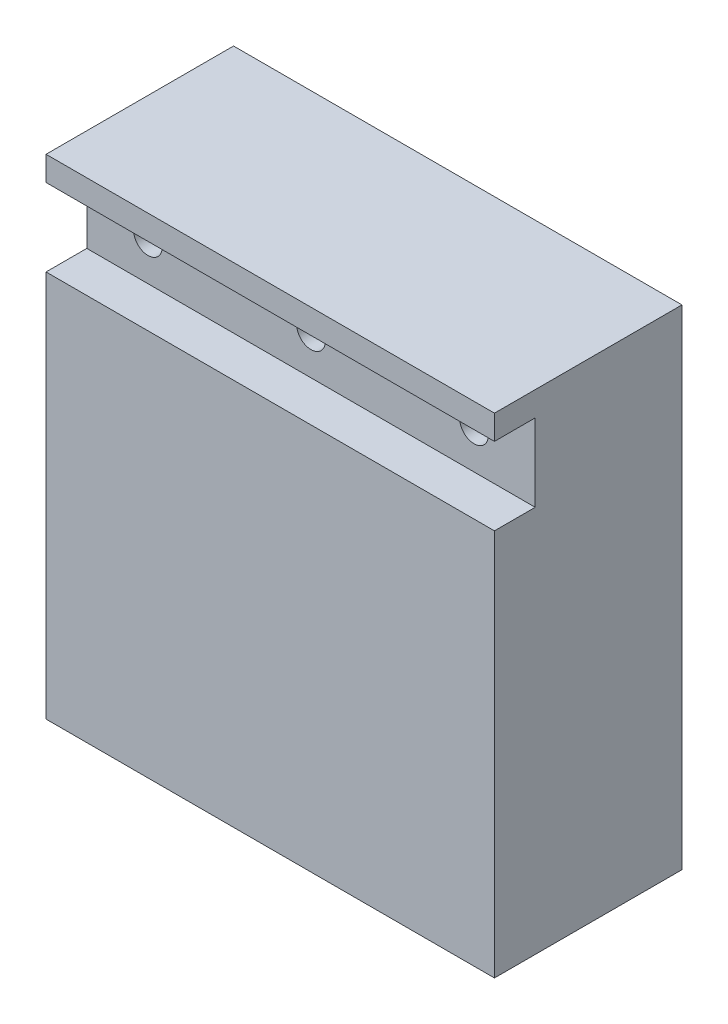
ISO-10303-21;
HEADER;
FILE_DESCRIPTION(('STEP AP214'),'2;1');
FILE_NAME('part.step','',(''),(''),'','','');
FILE_SCHEMA(('AUTOMOTIVE_DESIGN { 1 0 10303 214 1 1 1 1 }'));
ENDSEC;
DATA;
#1=APPLICATION_CONTEXT('core data for automotive mechanical design processes');
#2=APPLICATION_PROTOCOL_DEFINITION('international standard','automotive_design',2000,#1);
#3=PRODUCT_CONTEXT('',#1,'mechanical');
#4=PRODUCT('Part','Part','',(#3));
#5=PRODUCT_RELATED_PRODUCT_CATEGORY('part','',(#4));
#6=PRODUCT_DEFINITION_FORMATION('','',#4);
#7=PRODUCT_DEFINITION_CONTEXT('part definition',#1,'design');
#8=PRODUCT_DEFINITION('design','',#6,#7);
#9=PRODUCT_DEFINITION_SHAPE('','',#8);
#10=(LENGTH_UNIT() NAMED_UNIT(*) SI_UNIT(.MILLI.,.METRE.));
#11=(NAMED_UNIT(*) PLANE_ANGLE_UNIT() SI_UNIT($,.RADIAN.));
#12=(NAMED_UNIT(*) SI_UNIT($,.STERADIAN.) SOLID_ANGLE_UNIT());
#13=UNCERTAINTY_MEASURE_WITH_UNIT(LENGTH_MEASURE(1.E-05),#10,'distance_accuracy_value','');
#14=(GEOMETRIC_REPRESENTATION_CONTEXT(3) GLOBAL_UNCERTAINTY_ASSIGNED_CONTEXT((#13)) GLOBAL_UNIT_ASSIGNED_CONTEXT((#10,
#11,#12)) REPRESENTATION_CONTEXT('',''));
#15=CARTESIAN_POINT('',(0.,0.,0.));
#16=DIRECTION('',(0.,0.,1.));
#17=DIRECTION('',(1.,0.,0.));
#18=AXIS2_PLACEMENT_3D('',#15,#16,#17);
#19=CARTESIAN_POINT('',(55.,0.,0.));
#20=DIRECTION('',(0.,0.,-1.));
#21=DIRECTION('',(-1.,0.,0.));
#22=AXIS2_PLACEMENT_3D('',#19,#20,#21);
#23=PLANE('',#22);
#24=DIRECTION('',(0.,-1.,0.));
#25=VECTOR('',#24,1.);
#26=CARTESIAN_POINT('',(0.,0.,0.));
#27=LINE('',#26,#25);
#28=CARTESIAN_POINT('',(0.,60.,0.));
#29=VERTEX_POINT('',#28);
#30=CARTESIAN_POINT('',(0.,57.,0.));
#31=VERTEX_POINT('',#30);
#32=EDGE_CURVE('E162',#29,#31,#27,.T.);
#33=ORIENTED_EDGE('',*,*,#32,.T.);
#34=DIRECTION('',(-1.,0.,0.));
#35=VECTOR('',#34,1.);
#36=CARTESIAN_POINT('',(0.,57.,0.));
#37=LINE('',#36,#35);
#38=CARTESIAN_POINT('',(55.,57.,0.));
#39=VERTEX_POINT('',#38);
#40=EDGE_CURVE('E135',#39,#31,#37,.T.);
#41=ORIENTED_EDGE('',*,*,#40,.F.);
#42=DIRECTION('',(0.,-1.,0.));
#43=VECTOR('',#42,1.);
#44=CARTESIAN_POINT('',(55.,0.,0.));
#45=LINE('',#44,#43);
#46=CARTESIAN_POINT('',(55.,60.,0.));
#47=VERTEX_POINT('',#46);
#48=EDGE_CURVE('E150',#47,#39,#45,.T.);
#49=ORIENTED_EDGE('',*,*,#48,.F.);
#50=DIRECTION('',(-1.,0.,0.));
#51=VECTOR('',#50,1.);
#52=CARTESIAN_POINT('',(55.,60.,0.));
#53=LINE('',#52,#51);
#54=EDGE_CURVE('E161',#47,#29,#53,.T.);
#55=ORIENTED_EDGE('',*,*,#54,.T.);
#56=EDGE_LOOP('',(#33,#41,#49,#55));
#57=FACE_BOUND('',#56,.T.);
#58=ADVANCED_FACE('F43',(#57),#23,.F.);
#59=CARTESIAN_POINT('',(55.,47.5,0.));
#60=VERTEX_POINT('',#59);
#61=CARTESIAN_POINT('',(55.,0.,0.));
#62=VERTEX_POINT('',#61);
#63=EDGE_CURVE('E96',#60,#62,#45,.T.);
#64=ORIENTED_EDGE('',*,*,#63,.F.);
#65=DIRECTION('',(1.,0.,0.));
#66=VECTOR('',#65,1.);
#67=CARTESIAN_POINT('',(0.,47.5,0.));
#68=LINE('',#67,#66);
#69=CARTESIAN_POINT('',(0.,47.5,0.));
#70=VERTEX_POINT('',#69);
#71=EDGE_CURVE('E213',#70,#60,#68,.T.);
#72=ORIENTED_EDGE('',*,*,#71,.F.);
#73=CARTESIAN_POINT('',(0.,0.,0.));
#74=VERTEX_POINT('',#73);
#75=EDGE_CURVE('E140',#70,#74,#27,.T.);
#76=ORIENTED_EDGE('',*,*,#75,.T.);
#77=DIRECTION('',(-1.,0.,0.));
#78=VECTOR('',#77,1.);
#79=CARTESIAN_POINT('',(55.,0.,0.));
#80=LINE('',#79,#78);
#81=EDGE_CURVE('E11',#62,#74,#80,.T.);
#82=ORIENTED_EDGE('',*,*,#81,.F.);
#83=EDGE_LOOP('',(#64,#72,#76,#82));
#84=FACE_BOUND('',#83,.T.);
#85=ADVANCED_FACE('F45',(#84),#23,.F.);
#86=CARTESIAN_POINT('',(55.,0.,0.));
#87=DIRECTION('',(0.,1.,0.));
#88=DIRECTION('',(0.,0.,1.));
#89=AXIS2_PLACEMENT_3D('',#86,#87,#88);
#90=PLANE('',#89);
#91=DIRECTION('',(0.,0.,-1.));
#92=VECTOR('',#91,1.);
#93=CARTESIAN_POINT('',(0.,0.,0.));
#94=LINE('',#93,#92);
#95=CARTESIAN_POINT('',(0.,0.,-23.));
#96=VERTEX_POINT('',#95);
#97=EDGE_CURVE('E166',#74,#96,#94,.T.);
#98=ORIENTED_EDGE('',*,*,#97,.T.);
#99=DIRECTION('',(-1.,0.,0.));
#100=VECTOR('',#99,1.);
#101=CARTESIAN_POINT('',(55.,0.,-23.));
#102=LINE('',#101,#100);
#103=CARTESIAN_POINT('',(55.,0.,-23.));
#104=VERTEX_POINT('',#103);
#105=EDGE_CURVE('E52',#104,#96,#102,.T.);
#106=ORIENTED_EDGE('',*,*,#105,.F.);
#107=DIRECTION('',(0.,0.,-1.));
#108=VECTOR('',#107,1.);
#109=CARTESIAN_POINT('',(55.,0.,0.));
#110=LINE('',#109,#108);
#111=EDGE_CURVE('E153',#62,#104,#110,.T.);
#112=ORIENTED_EDGE('',*,*,#111,.F.);
#113=ORIENTED_EDGE('',*,*,#81,.T.);
#114=EDGE_LOOP('',(#98,#106,#112,#113));
#115=FACE_BOUND('',#114,.T.);
#116=ADVANCED_FACE('F201',(#115),#90,.F.);
#117=CARTESIAN_POINT('',(55.,0.,-23.));
#118=DIRECTION('',(0.,0.,1.));
#119=DIRECTION('',(1.,0.,0.));
#120=AXIS2_PLACEMENT_3D('',#117,#118,#119);
#121=PLANE('',#120);
#122=DIRECTION('',(0.,1.,0.));
#123=VECTOR('',#122,1.);
#124=CARTESIAN_POINT('',(0.,0.,-23.));
#125=LINE('',#124,#123);
#126=CARTESIAN_POINT('',(0.,60.,-23.));
#127=VERTEX_POINT('',#126);
#128=EDGE_CURVE('E169',#96,#127,#125,.T.);
#129=ORIENTED_EDGE('',*,*,#128,.T.);
#130=DIRECTION('',(-1.,0.,0.));
#131=VECTOR('',#130,1.);
#132=CARTESIAN_POINT('',(55.,60.,-23.));
#133=LINE('',#132,#131);
#134=CARTESIAN_POINT('',(55.,60.,-23.));
#135=VERTEX_POINT('',#134);
#136=EDGE_CURVE('E176',#135,#127,#133,.T.);
#137=ORIENTED_EDGE('',*,*,#136,.F.);
#138=DIRECTION('',(0.,1.,0.));
#139=VECTOR('',#138,1.);
#140=CARTESIAN_POINT('',(55.,0.,-23.));
#141=LINE('',#140,#139);
#142=EDGE_CURVE('E156',#104,#135,#141,.T.);
#143=ORIENTED_EDGE('',*,*,#142,.F.);
#144=ORIENTED_EDGE('',*,*,#105,.T.);
#145=EDGE_LOOP('',(#129,#137,#143,#144));
#146=FACE_BOUND('',#145,.T.);
#147=ADVANCED_FACE('F184',(#146),#121,.F.);
#148=CARTESIAN_POINT('',(55.,60.,0.));
#149=DIRECTION('',(0.,-1.,0.));
#150=DIRECTION('',(0.,0.,-1.));
#151=AXIS2_PLACEMENT_3D('',#148,#149,#150);
#152=PLANE('',#151);
#153=DIRECTION('',(0.,0.,1.));
#154=VECTOR('',#153,1.);
#155=CARTESIAN_POINT('',(0.,60.,0.));
#156=LINE('',#155,#154);
#157=EDGE_CURVE('E89',#127,#29,#156,.T.);
#158=ORIENTED_EDGE('',*,*,#157,.T.);
#159=ORIENTED_EDGE('',*,*,#54,.F.);
#160=DIRECTION('',(0.,0.,1.));
#161=VECTOR('',#160,1.);
#162=CARTESIAN_POINT('',(55.,60.,0.));
#163=LINE('',#162,#161);
#164=EDGE_CURVE('E68',#135,#47,#163,.T.);
#165=ORIENTED_EDGE('',*,*,#164,.F.);
#166=ORIENTED_EDGE('',*,*,#136,.T.);
#167=EDGE_LOOP('',(#158,#159,#165,#166));
#168=FACE_BOUND('',#167,.T.);
#169=ADVANCED_FACE('F192',(#168),#152,.F.);
#170=CARTESIAN_POINT('',(55.,0.,0.));
#171=DIRECTION('',(-1.,0.,0.));
#172=DIRECTION('',(0.,0.,1.));
#173=AXIS2_PLACEMENT_3D('',#170,#171,#172);
#174=PLANE('',#173);
#175=ORIENTED_EDGE('',*,*,#48,.T.);
#176=DIRECTION('',(0.,0.,1.));
#177=VECTOR('',#176,1.);
#178=CARTESIAN_POINT('',(55.,57.,-5.));
#179=LINE('',#178,#177);
#180=CARTESIAN_POINT('',(55.,57.,-5.));
#181=VERTEX_POINT('',#180);
#182=EDGE_CURVE('E145',#181,#39,#179,.T.);
#183=ORIENTED_EDGE('',*,*,#182,.F.);
#184=DIRECTION('',(0.,1.,0.));
#185=VECTOR('',#184,1.);
#186=CARTESIAN_POINT('',(55.,57.,-5.));
#187=LINE('',#186,#185);
#188=CARTESIAN_POINT('',(55.,47.5,-5.));
#189=VERTEX_POINT('',#188);
#190=EDGE_CURVE('E127',#189,#181,#187,.T.);
#191=ORIENTED_EDGE('',*,*,#190,.F.);
#192=DIRECTION('',(0.,0.,1.));
#193=VECTOR('',#192,1.);
#194=CARTESIAN_POINT('',(55.,47.5,-5.));
#195=LINE('',#194,#193);
#196=EDGE_CURVE('E124',#189,#60,#195,.T.);
#197=ORIENTED_EDGE('',*,*,#196,.T.);
#198=ORIENTED_EDGE('',*,*,#63,.T.);
#199=ORIENTED_EDGE('',*,*,#111,.T.);
#200=ORIENTED_EDGE('',*,*,#142,.T.);
#201=ORIENTED_EDGE('',*,*,#164,.T.);
#202=EDGE_LOOP('',(#175,#183,#191,#197,#198,#199,#200,#201));
#203=FACE_BOUND('',#202,.T.);
#204=ADVANCED_FACE('F194',(#203),#174,.F.);
#205=CARTESIAN_POINT('',(0.,0.,0.));
#206=DIRECTION('',(-1.,0.,0.));
#207=DIRECTION('',(0.,0.,1.));
#208=AXIS2_PLACEMENT_3D('',#205,#206,#207);
#209=PLANE('',#208);
#210=DIRECTION('',(0.,0.,1.));
#211=VECTOR('',#210,1.);
#212=CARTESIAN_POINT('',(0.,57.,-5.));
#213=LINE('',#212,#211);
#214=CARTESIAN_POINT('',(0.,57.,-5.));
#215=VERTEX_POINT('',#214);
#216=EDGE_CURVE('E188',#215,#31,#213,.T.);
#217=ORIENTED_EDGE('',*,*,#216,.T.);
#218=ORIENTED_EDGE('',*,*,#32,.F.);
#219=ORIENTED_EDGE('',*,*,#157,.F.);
#220=ORIENTED_EDGE('',*,*,#128,.F.);
#221=ORIENTED_EDGE('',*,*,#97,.F.);
#222=ORIENTED_EDGE('',*,*,#75,.F.);
#223=DIRECTION('',(0.,0.,1.));
#224=VECTOR('',#223,1.);
#225=CARTESIAN_POINT('',(0.,47.5,-5.));
#226=LINE('',#225,#224);
#227=CARTESIAN_POINT('',(0.,47.5,-5.));
#228=VERTEX_POINT('',#227);
#229=EDGE_CURVE('E122',#228,#70,#226,.T.);
#230=ORIENTED_EDGE('',*,*,#229,.F.);
#231=DIRECTION('',(0.,-1.,0.));
#232=VECTOR('',#231,1.);
#233=CARTESIAN_POINT('',(0.,57.,-5.));
#234=LINE('',#233,#232);
#235=EDGE_CURVE('E128',#215,#228,#234,.T.);
#236=ORIENTED_EDGE('',*,*,#235,.F.);
#237=EDGE_LOOP('',(#217,#218,#219,#220,#221,#222,#230,#236));
#238=FACE_BOUND('',#237,.T.);
#239=ADVANCED_FACE('F138',(#238),#209,.T.);
#240=CARTESIAN_POINT('',(0.,57.,-5.));
#241=DIRECTION('',(0.,1.,0.));
#242=DIRECTION('',(0.,0.,1.));
#243=AXIS2_PLACEMENT_3D('',#240,#241,#242);
#244=PLANE('',#243);
#245=ORIENTED_EDGE('',*,*,#40,.T.);
#246=ORIENTED_EDGE('',*,*,#216,.F.);
#247=DIRECTION('',(-1.,0.,0.));
#248=VECTOR('',#247,1.);
#249=CARTESIAN_POINT('',(0.,57.,-5.));
#250=LINE('',#249,#248);
#251=EDGE_CURVE('E59',#181,#215,#250,.T.);
#252=ORIENTED_EDGE('',*,*,#251,.F.);
#253=ORIENTED_EDGE('',*,*,#182,.T.);
#254=EDGE_LOOP('',(#245,#246,#252,#253));
#255=FACE_BOUND('',#254,.T.);
#256=ADVANCED_FACE('F284',(#255),#244,.F.);
#257=CARTESIAN_POINT('',(0.,47.5,-5.));
#258=DIRECTION('',(0.,-1.,0.));
#259=DIRECTION('',(0.,0.,-1.));
#260=AXIS2_PLACEMENT_3D('',#257,#258,#259);
#261=PLANE('',#260);
#262=ORIENTED_EDGE('',*,*,#71,.T.);
#263=ORIENTED_EDGE('',*,*,#196,.F.);
#264=DIRECTION('',(1.,0.,0.));
#265=VECTOR('',#264,1.);
#266=CARTESIAN_POINT('',(0.,47.5,-5.));
#267=LINE('',#266,#265);
#268=EDGE_CURVE('E119',#228,#189,#267,.T.);
#269=ORIENTED_EDGE('',*,*,#268,.F.);
#270=ORIENTED_EDGE('',*,*,#229,.T.);
#271=EDGE_LOOP('',(#262,#263,#269,#270));
#272=FACE_BOUND('',#271,.T.);
#273=ADVANCED_FACE('F120',(#272),#261,.F.);
#274=CARTESIAN_POINT('',(0.,0.,-5.));
#275=DIRECTION('',(0.,0.,1.));
#276=DIRECTION('',(1.,0.,0.));
#277=AXIS2_PLACEMENT_3D('',#274,#275,#276);
#278=PLANE('',#277);
#279=CARTESIAN_POINT('',(7.5,52.25,-5.));
#280=DIRECTION('',(0.,0.,1.));
#281=DIRECTION('',(1.,0.,0.));
#282=AXIS2_PLACEMENT_3D('',#279,#280,#281);
#283=CIRCLE('',#282,1.75);
#284=CARTESIAN_POINT('',(9.25,52.25,-5.));
#285=VERTEX_POINT('',#284);
#286=EDGE_CURVE('E245',#285,#285,#283,.T.);
#287=ORIENTED_EDGE('',*,*,#286,.F.);
#288=EDGE_LOOP('',(#287));
#289=FACE_BOUND('',#288,.T.);
#290=CARTESIAN_POINT('',(27.5,52.25,-5.));
#291=DIRECTION('',(0.,0.,1.));
#292=DIRECTION('',(1.,0.,0.));
#293=AXIS2_PLACEMENT_3D('',#290,#291,#292);
#294=CIRCLE('',#293,1.75);
#295=CARTESIAN_POINT('',(29.25,52.25,-5.));
#296=VERTEX_POINT('',#295);
#297=EDGE_CURVE('E241',#296,#296,#294,.T.);
#298=ORIENTED_EDGE('',*,*,#297,.F.);
#299=EDGE_LOOP('',(#298));
#300=FACE_BOUND('',#299,.T.);
#301=CARTESIAN_POINT('',(47.5,52.25,-5.));
#302=DIRECTION('',(0.,0.,1.));
#303=DIRECTION('',(1.,0.,0.));
#304=AXIS2_PLACEMENT_3D('',#301,#302,#303);
#305=CIRCLE('',#304,1.75);
#306=CARTESIAN_POINT('',(49.25,52.25,-5.));
#307=VERTEX_POINT('',#306);
#308=EDGE_CURVE('E233',#307,#307,#305,.T.);
#309=ORIENTED_EDGE('',*,*,#308,.F.);
#310=EDGE_LOOP('',(#309));
#311=FACE_BOUND('',#310,.T.);
#312=ORIENTED_EDGE('',*,*,#235,.T.);
#313=ORIENTED_EDGE('',*,*,#268,.T.);
#314=ORIENTED_EDGE('',*,*,#190,.T.);
#315=ORIENTED_EDGE('',*,*,#251,.T.);
#316=EDGE_LOOP('',(#312,#313,#314,#315));
#317=FACE_BOUND('',#316,.T.);
#318=ADVANCED_FACE('F131',(#289,#300,#311,#317),#278,.T.);
#319=CARTESIAN_POINT('',(47.5,52.25,-8.));
#320=DIRECTION('',(0.,0.,1.));
#321=DIRECTION('',(1.,0.,0.));
#322=AXIS2_PLACEMENT_3D('',#319,#320,#321);
#323=CYLINDRICAL_SURFACE('',#322,1.75);
#324=CARTESIAN_POINT('',(47.5,52.25,-8.));
#325=DIRECTION('',(0.,0.,1.));
#326=DIRECTION('',(1.,0.,0.));
#327=AXIS2_PLACEMENT_3D('',#324,#325,#326);
#328=CIRCLE('',#327,1.75);
#329=CARTESIAN_POINT('',(49.25,52.25,-8.));
#330=VERTEX_POINT('',#329);
#331=EDGE_CURVE('E229',#330,#330,#328,.T.);
#332=ORIENTED_EDGE('',*,*,#331,.F.);
#333=EDGE_LOOP('',(#332));
#334=FACE_BOUND('',#333,.T.);
#335=ORIENTED_EDGE('',*,*,#308,.T.);
#336=EDGE_LOOP('',(#335));
#337=FACE_BOUND('',#336,.T.);
#338=ADVANCED_FACE('F264',(#334,#337),#323,.F.);
#339=CARTESIAN_POINT('',(47.5,52.25,-8.));
#340=DIRECTION('',(0.,0.,1.));
#341=DIRECTION('',(1.,0.,0.));
#342=AXIS2_PLACEMENT_3D('',#339,#340,#341);
#343=PLANE('',#342);
#344=ORIENTED_EDGE('',*,*,#331,.T.);
#345=EDGE_LOOP('',(#344));
#346=FACE_BOUND('',#345,.T.);
#347=ADVANCED_FACE('F271',(#346),#343,.T.);
#348=CARTESIAN_POINT('',(27.5,52.25,-8.));
#349=DIRECTION('',(0.,0.,1.));
#350=DIRECTION('',(1.,0.,0.));
#351=AXIS2_PLACEMENT_3D('',#348,#349,#350);
#352=CYLINDRICAL_SURFACE('',#351,1.75);
#353=CARTESIAN_POINT('',(27.5,52.25,-8.));
#354=DIRECTION('',(0.,0.,1.));
#355=DIRECTION('',(1.,0.,0.));
#356=AXIS2_PLACEMENT_3D('',#353,#354,#355);
#357=CIRCLE('',#356,1.75);
#358=CARTESIAN_POINT('',(29.25,52.25,-8.));
#359=VERTEX_POINT('',#358);
#360=EDGE_CURVE('E237',#359,#359,#357,.T.);
#361=ORIENTED_EDGE('',*,*,#360,.F.);
#362=EDGE_LOOP('',(#361));
#363=FACE_BOUND('',#362,.T.);
#364=ORIENTED_EDGE('',*,*,#297,.T.);
#365=EDGE_LOOP('',(#364));
#366=FACE_BOUND('',#365,.T.);
#367=ADVANCED_FACE('F277',(#363,#366),#352,.F.);
#368=CARTESIAN_POINT('',(27.5,52.25,-8.));
#369=DIRECTION('',(0.,0.,1.));
#370=DIRECTION('',(1.,0.,0.));
#371=AXIS2_PLACEMENT_3D('',#368,#369,#370);
#372=PLANE('',#371);
#373=ORIENTED_EDGE('',*,*,#360,.T.);
#374=EDGE_LOOP('',(#373));
#375=FACE_BOUND('',#374,.T.);
#376=ADVANCED_FACE('F258',(#375),#372,.T.);
#377=CARTESIAN_POINT('',(7.5,52.25,-8.));
#378=DIRECTION('',(0.,0.,1.));
#379=DIRECTION('',(1.,0.,0.));
#380=AXIS2_PLACEMENT_3D('',#377,#378,#379);
#381=CYLINDRICAL_SURFACE('',#380,1.75);
#382=CARTESIAN_POINT('',(7.5,52.25,-8.));
#383=DIRECTION('',(0.,0.,1.));
#384=DIRECTION('',(1.,0.,0.));
#385=AXIS2_PLACEMENT_3D('',#382,#383,#384);
#386=CIRCLE('',#385,1.75);
#387=CARTESIAN_POINT('',(9.25,52.25,-8.));
#388=VERTEX_POINT('',#387);
#389=EDGE_CURVE('E225',#388,#388,#386,.T.);
#390=ORIENTED_EDGE('',*,*,#389,.F.);
#391=EDGE_LOOP('',(#390));
#392=FACE_BOUND('',#391,.T.);
#393=ORIENTED_EDGE('',*,*,#286,.T.);
#394=EDGE_LOOP('',(#393));
#395=FACE_BOUND('',#394,.T.);
#396=ADVANCED_FACE('F255',(#392,#395),#381,.F.);
#397=CARTESIAN_POINT('',(7.5,52.25,-8.));
#398=DIRECTION('',(0.,0.,1.));
#399=DIRECTION('',(1.,0.,0.));
#400=AXIS2_PLACEMENT_3D('',#397,#398,#399);
#401=PLANE('',#400);
#402=ORIENTED_EDGE('',*,*,#389,.T.);
#403=EDGE_LOOP('',(#402));
#404=FACE_BOUND('',#403,.T.);
#405=ADVANCED_FACE('F253',(#404),#401,.T.);
#406=CLOSED_SHELL('',(#58,#85,#116,#147,#169,#204,#239,#256,#273,#318,#338,#347,#367,#376,#396,#405));
#407=MANIFOLD_SOLID_BREP('B2',#406);
#408=ADVANCED_BREP_SHAPE_REPRESENTATION('',(#18,#407),#14);
#409=SHAPE_DEFINITION_REPRESENTATION(#9,#408);
ENDSEC;
END-ISO-10303-21;
